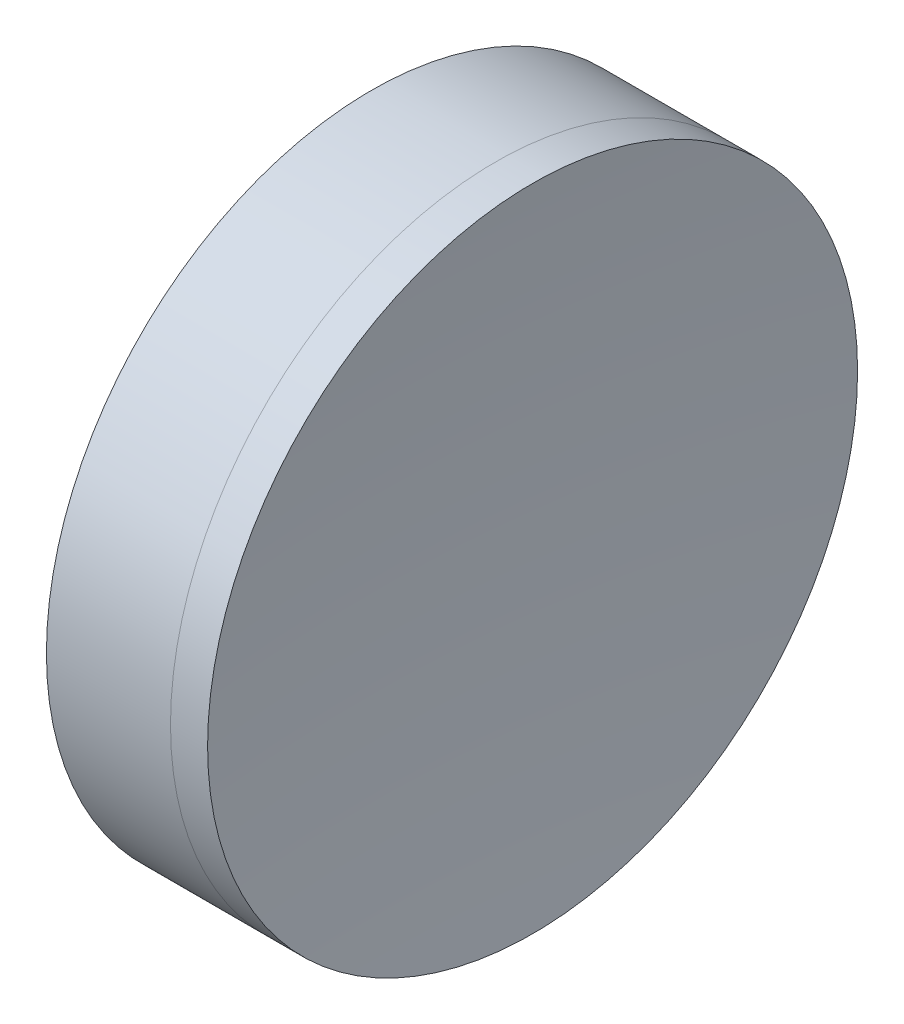
ISO-10303-21;
HEADER;
FILE_DESCRIPTION(('STEP AP214'),'2;1');
FILE_NAME('part.step','',(''),(''),'','','');
FILE_SCHEMA(('AUTOMOTIVE_DESIGN { 1 0 10303 214 1 1 1 1 }'));
ENDSEC;
DATA;
#1=APPLICATION_CONTEXT('core data for automotive mechanical design processes');
#2=APPLICATION_PROTOCOL_DEFINITION('international standard','automotive_design',2000,#1);
#3=PRODUCT_CONTEXT('',#1,'mechanical');
#4=PRODUCT('Part','Part','',(#3));
#5=PRODUCT_RELATED_PRODUCT_CATEGORY('part','',(#4));
#6=PRODUCT_DEFINITION_FORMATION('','',#4);
#7=PRODUCT_DEFINITION_CONTEXT('part definition',#1,'design');
#8=PRODUCT_DEFINITION('design','',#6,#7);
#9=PRODUCT_DEFINITION_SHAPE('','',#8);
#10=(LENGTH_UNIT() NAMED_UNIT(*) SI_UNIT(.MILLI.,.METRE.));
#11=(NAMED_UNIT(*) PLANE_ANGLE_UNIT() SI_UNIT($,.RADIAN.));
#12=(NAMED_UNIT(*) SI_UNIT($,.STERADIAN.) SOLID_ANGLE_UNIT());
#13=UNCERTAINTY_MEASURE_WITH_UNIT(LENGTH_MEASURE(1.E-05),#10,'distance_accuracy_value','');
#14=(GEOMETRIC_REPRESENTATION_CONTEXT(3) GLOBAL_UNCERTAINTY_ASSIGNED_CONTEXT((#13)) GLOBAL_UNIT_ASSIGNED_CONTEXT((#10,
#11,#12)) REPRESENTATION_CONTEXT('',''));
#15=CARTESIAN_POINT('',(0.,0.,0.));
#16=DIRECTION('',(0.,0.,1.));
#17=DIRECTION('',(1.,0.,0.));
#18=AXIS2_PLACEMENT_3D('',#15,#16,#17);
#19=CARTESIAN_POINT('',(318.122811453287,0.,0.));
#20=DIRECTION('',(-1.,0.,0.));
#21=DIRECTION('',(0.,0.,-1.));
#22=AXIS2_PLACEMENT_3D('',#19,#20,#21);
#23=SPHERICAL_SURFACE('',#22,69.82);
#24=CARTESIAN_POINT('',(251.228623364934,0.,0.));
#25=DIRECTION('',(-1.,0.,0.));
#26=DIRECTION('',(0.,0.,1.));
#27=AXIS2_PLACEMENT_3D('',#24,#25,#26);
#28=CIRCLE('',#27,20.);
#29=CARTESIAN_POINT('',(251.228623364934,0.,20.));
#30=VERTEX_POINT('',#29);
#31=EDGE_CURVE('E11',#30,#30,#28,.T.);
#32=ORIENTED_EDGE('',*,*,#31,.T.);
#33=EDGE_LOOP('',(#32));
#34=FACE_BOUND('',#33,.T.);
#35=ADVANCED_FACE('F45',(#34),#23,.T.);
#36=CARTESIAN_POINT('',(243.593238138322,0.,0.));
#37=DIRECTION('',(-1.,0.,0.));
#38=DIRECTION('',(0.,0.,1.));
#39=AXIS2_PLACEMENT_3D('',#36,#37,#38);
#40=CYLINDRICAL_SURFACE('',#39,20.);
#41=CARTESIAN_POINT('',(253.511950082257,0.,0.));
#42=DIRECTION('',(-1.,0.,0.));
#43=DIRECTION('',(0.,0.,1.));
#44=AXIS2_PLACEMENT_3D('',#41,#42,#43);
#45=CIRCLE('',#44,20.);
#46=CARTESIAN_POINT('',(253.511950082257,0.,20.));
#47=VERTEX_POINT('',#46);
#48=EDGE_CURVE('E51',#47,#47,#45,.T.);
#49=ORIENTED_EDGE('',*,*,#48,.T.);
#50=EDGE_LOOP('',(#49));
#51=FACE_BOUND('',#50,.T.);
#52=ORIENTED_EDGE('',*,*,#31,.F.);
#53=EDGE_LOOP('',(#52));
#54=FACE_BOUND('',#53,.T.);
#55=ADVANCED_FACE('F57',(#51,#54),#40,.T.);
#56=CARTESIAN_POINT('',(461.552811453287,0.,0.));
#57=DIRECTION('',(-1.,0.,0.));
#58=DIRECTION('',(0.,0.,-1.));
#59=AXIS2_PLACEMENT_3D('',#56,#57,#58);
#60=SPHERICAL_SURFACE('',#59,209.);
#61=ORIENTED_EDGE('',*,*,#48,.F.);
#62=EDGE_LOOP('',(#61));
#63=FACE_BOUND('',#62,.T.);
#64=ADVANCED_FACE('F60',(#63),#60,.F.);
#65=CLOSED_SHELL('',(#35,#55,#64));
#66=MANIFOLD_SOLID_BREP('B2',#65);
#67=CARTESIAN_POINT('',(154.182811453287,0.,0.));
#68=DIRECTION('',(-1.,0.,0.));
#69=DIRECTION('',(0.,0.,1.));
#70=AXIS2_PLACEMENT_3D('',#67,#68,#69);
#71=SPHERICAL_SURFACE('',#70,91.62);
#72=CARTESIAN_POINT('',(243.593238138322,0.,0.));
#73=DIRECTION('',(-1.,0.,0.));
#74=DIRECTION('',(0.,0.,1.));
#75=AXIS2_PLACEMENT_3D('',#72,#73,#74);
#76=CIRCLE('',#75,20.);
#77=CARTESIAN_POINT('',(243.593238138322,0.,20.));
#78=VERTEX_POINT('',#77);
#79=EDGE_CURVE('E44',#78,#78,#76,.T.);
#80=ORIENTED_EDGE('',*,*,#79,.T.);
#81=EDGE_LOOP('',(#80));
#82=FACE_BOUND('',#81,.T.);
#83=ADVANCED_FACE('F86',(#82),#71,.F.);
#84=CARTESIAN_POINT('',(-0.816062176165804,0.,0.));
#85=DIRECTION('',(-1.,0.,0.));
#86=DIRECTION('',(0.,0.,1.));
#87=AXIS2_PLACEMENT_3D('',#84,#85,#86);
#88=CYLINDRICAL_SURFACE('',#87,20.);
#89=CARTESIAN_POINT('',(251.228623364934,0.,0.));
#90=DIRECTION('',(-1.,0.,0.));
#91=DIRECTION('',(0.,0.,1.));
#92=AXIS2_PLACEMENT_3D('',#89,#90,#91);
#93=CIRCLE('',#92,20.);
#94=CARTESIAN_POINT('',(251.228623364934,0.,20.));
#95=VERTEX_POINT('',#94);
#96=EDGE_CURVE('E92',#95,#95,#93,.T.);
#97=ORIENTED_EDGE('',*,*,#96,.T.);
#98=EDGE_LOOP('',(#97));
#99=FACE_BOUND('',#98,.T.);
#100=ORIENTED_EDGE('',*,*,#79,.F.);
#101=EDGE_LOOP('',(#100));
#102=FACE_BOUND('',#101,.T.);
#103=ADVANCED_FACE('F98',(#99,#102),#88,.T.);
#104=CARTESIAN_POINT('',(318.122811453287,0.,0.));
#105=DIRECTION('',(-1.,0.,0.));
#106=DIRECTION('',(0.,0.,-1.));
#107=AXIS2_PLACEMENT_3D('',#104,#105,#106);
#108=SPHERICAL_SURFACE('',#107,69.82);
#109=ORIENTED_EDGE('',*,*,#96,.F.);
#110=EDGE_LOOP('',(#109));
#111=FACE_BOUND('',#110,.T.);
#112=ADVANCED_FACE('F101',(#111),#108,.F.);
#113=CLOSED_SHELL('',(#83,#103,#112));
#114=MANIFOLD_SOLID_BREP('B6',#113);
#115=ADVANCED_BREP_SHAPE_REPRESENTATION('',(#18,#66,#114),#14);
#116=SHAPE_DEFINITION_REPRESENTATION(#9,#115);
ENDSEC;
END-ISO-10303-21;
